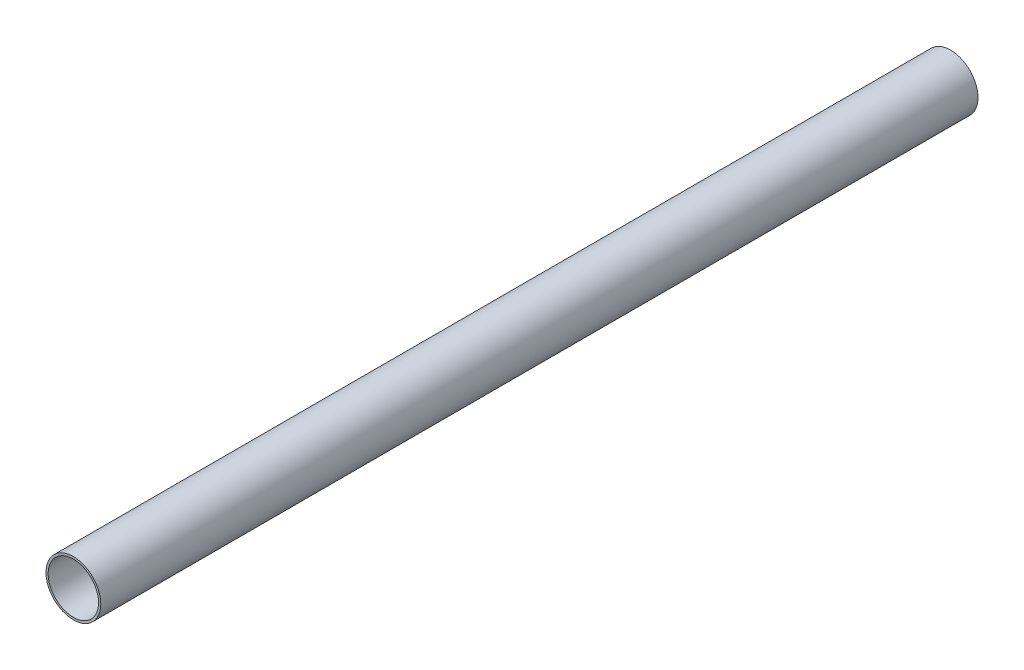
ISO-10303-21;
HEADER;
FILE_DESCRIPTION(('STEP AP214'),'2;1');
FILE_NAME('part.step','',(''),(''),'','','');
FILE_SCHEMA(('AUTOMOTIVE_DESIGN { 1 0 10303 214 1 1 1 1 }'));
ENDSEC;
DATA;
#1=APPLICATION_CONTEXT('core data for automotive mechanical design processes');
#2=APPLICATION_PROTOCOL_DEFINITION('international standard','automotive_design',2000,#1);
#3=PRODUCT_CONTEXT('',#1,'mechanical');
#4=PRODUCT('Part','Part','',(#3));
#5=PRODUCT_RELATED_PRODUCT_CATEGORY('part','',(#4));
#6=PRODUCT_DEFINITION_FORMATION('','',#4);
#7=PRODUCT_DEFINITION_CONTEXT('part definition',#1,'design');
#8=PRODUCT_DEFINITION('design','',#6,#7);
#9=PRODUCT_DEFINITION_SHAPE('','',#8);
#10=(LENGTH_UNIT() NAMED_UNIT(*) SI_UNIT(.MILLI.,.METRE.));
#11=(NAMED_UNIT(*) PLANE_ANGLE_UNIT() SI_UNIT($,.RADIAN.));
#12=(NAMED_UNIT(*) SI_UNIT($,.STERADIAN.) SOLID_ANGLE_UNIT());
#13=UNCERTAINTY_MEASURE_WITH_UNIT(LENGTH_MEASURE(1.E-05),#10,'distance_accuracy_value','');
#14=(GEOMETRIC_REPRESENTATION_CONTEXT(3) GLOBAL_UNCERTAINTY_ASSIGNED_CONTEXT((#13)) GLOBAL_UNIT_ASSIGNED_CONTEXT((#10,
#11,#12)) REPRESENTATION_CONTEXT('',''));
#15=CARTESIAN_POINT('',(0.,0.,0.));
#16=DIRECTION('',(0.,0.,1.));
#17=DIRECTION('',(1.,0.,0.));
#18=AXIS2_PLACEMENT_3D('',#15,#16,#17);
#19=CARTESIAN_POINT('',(0.,0.,200.));
#20=DIRECTION('',(0.,0.,1.));
#21=DIRECTION('',(1.,0.,0.));
#22=AXIS2_PLACEMENT_3D('',#19,#20,#21);
#23=PLANE('',#22);
#24=CARTESIAN_POINT('',(0.,0.,200.));
#25=DIRECTION('',(0.,0.,1.));
#26=DIRECTION('',(1.,0.,0.));
#27=AXIS2_PLACEMENT_3D('',#24,#25,#26);
#28=CIRCLE('',#27,12.5);
#29=CARTESIAN_POINT('',(12.5,0.,200.));
#30=VERTEX_POINT('',#29);
#31=EDGE_CURVE('E10',#30,#30,#28,.T.);
#32=ORIENTED_EDGE('',*,*,#31,.T.);
#33=EDGE_LOOP('',(#32));
#34=FACE_BOUND('',#33,.T.);
#35=CARTESIAN_POINT('',(0.,0.,200.));
#36=DIRECTION('',(0.,0.,1.));
#37=DIRECTION('',(1.,0.,0.));
#38=AXIS2_PLACEMENT_3D('',#35,#36,#37);
#39=CIRCLE('',#38,11.5);
#40=CARTESIAN_POINT('',(11.5,0.,200.));
#41=VERTEX_POINT('',#40);
#42=EDGE_CURVE('E42',#41,#41,#39,.T.);
#43=ORIENTED_EDGE('',*,*,#42,.F.);
#44=EDGE_LOOP('',(#43));
#45=FACE_BOUND('',#44,.T.);
#46=ADVANCED_FACE('F31',(#34,#45),#23,.T.);
#47=CARTESIAN_POINT('',(0.,0.,-200.));
#48=DIRECTION('',(0.,0.,1.));
#49=DIRECTION('',(1.,0.,0.));
#50=AXIS2_PLACEMENT_3D('',#47,#48,#49);
#51=PLANE('',#50);
#52=CARTESIAN_POINT('',(0.,0.,-200.));
#53=DIRECTION('',(0.,0.,1.));
#54=DIRECTION('',(1.,0.,0.));
#55=AXIS2_PLACEMENT_3D('',#52,#53,#54);
#56=CIRCLE('',#55,12.5);
#57=CARTESIAN_POINT('',(12.5,0.,-200.));
#58=VERTEX_POINT('',#57);
#59=EDGE_CURVE('E35',#58,#58,#56,.T.);
#60=ORIENTED_EDGE('',*,*,#59,.F.);
#61=EDGE_LOOP('',(#60));
#62=FACE_BOUND('',#61,.T.);
#63=CARTESIAN_POINT('',(0.,0.,-200.));
#64=DIRECTION('',(0.,0.,1.));
#65=DIRECTION('',(1.,0.,0.));
#66=AXIS2_PLACEMENT_3D('',#63,#64,#65);
#67=CIRCLE('',#66,11.5);
#68=CARTESIAN_POINT('',(11.5,0.,-200.));
#69=VERTEX_POINT('',#68);
#70=EDGE_CURVE('E44',#69,#69,#67,.T.);
#71=ORIENTED_EDGE('',*,*,#70,.T.);
#72=EDGE_LOOP('',(#71));
#73=FACE_BOUND('',#72,.T.);
#74=ADVANCED_FACE('F54',(#62,#73),#51,.F.);
#75=CARTESIAN_POINT('',(0.,0.,200.));
#76=DIRECTION('',(0.,0.,-1.));
#77=DIRECTION('',(-1.,0.,0.));
#78=AXIS2_PLACEMENT_3D('',#75,#76,#77);
#79=CYLINDRICAL_SURFACE('',#78,12.5);
#80=ORIENTED_EDGE('',*,*,#31,.F.);
#81=EDGE_LOOP('',(#80));
#82=FACE_BOUND('',#81,.T.);
#83=ORIENTED_EDGE('',*,*,#59,.T.);
#84=EDGE_LOOP('',(#83));
#85=FACE_BOUND('',#84,.T.);
#86=ADVANCED_FACE('F33',(#82,#85),#79,.T.);
#87=CARTESIAN_POINT('',(0.,0.,200.));
#88=DIRECTION('',(0.,0.,-1.));
#89=DIRECTION('',(-1.,0.,0.));
#90=AXIS2_PLACEMENT_3D('',#87,#88,#89);
#91=CYLINDRICAL_SURFACE('',#90,11.5);
#92=ORIENTED_EDGE('',*,*,#42,.T.);
#93=EDGE_LOOP('',(#92));
#94=FACE_BOUND('',#93,.T.);
#95=ORIENTED_EDGE('',*,*,#70,.F.);
#96=EDGE_LOOP('',(#95));
#97=FACE_BOUND('',#96,.T.);
#98=ADVANCED_FACE('F50',(#94,#97),#91,.F.);
#99=CLOSED_SHELL('',(#46,#74,#86,#98));
#100=MANIFOLD_SOLID_BREP('B2',#99);
#101=ADVANCED_BREP_SHAPE_REPRESENTATION('',(#18,#100),#14);
#102=SHAPE_DEFINITION_REPRESENTATION(#9,#101);
ENDSEC;
END-ISO-10303-21;
